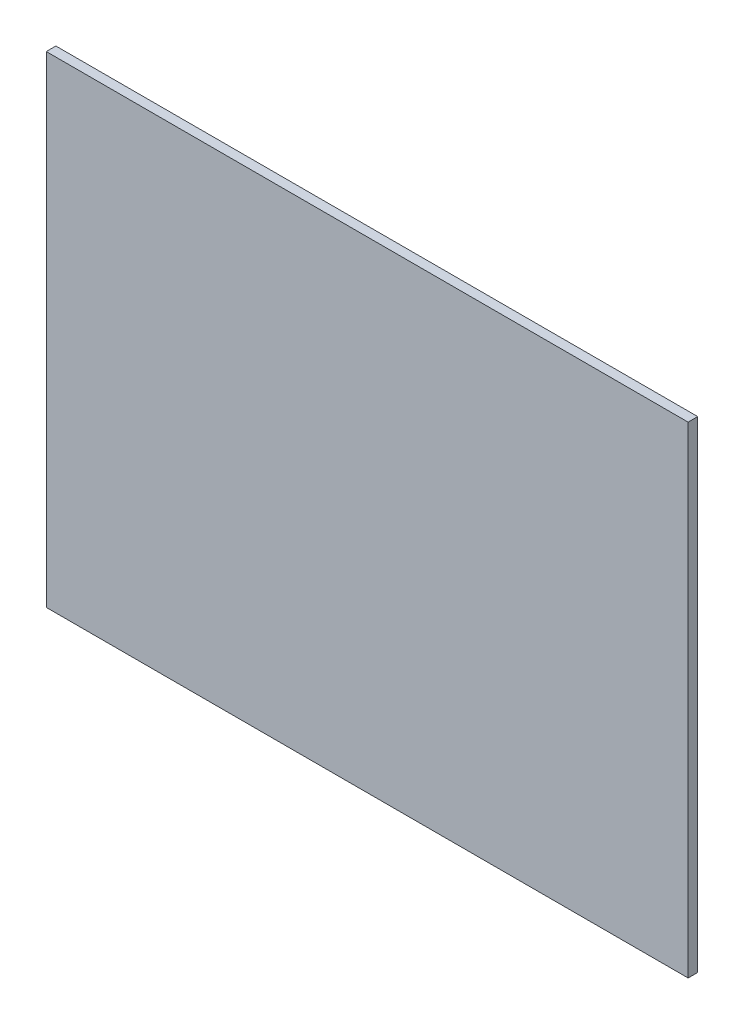
ISO-10303-21;
HEADER;
FILE_DESCRIPTION(('STEP AP214'),'2;1');
FILE_NAME('part.step','',(''),(''),'','','');
FILE_SCHEMA(('AUTOMOTIVE_DESIGN { 1 0 10303 214 1 1 1 1 }'));
ENDSEC;
DATA;
#1=APPLICATION_CONTEXT('core data for automotive mechanical design processes');
#2=APPLICATION_PROTOCOL_DEFINITION('international standard','automotive_design',2000,#1);
#3=PRODUCT_CONTEXT('',#1,'mechanical');
#4=PRODUCT('Part','Part','',(#3));
#5=PRODUCT_RELATED_PRODUCT_CATEGORY('part','',(#4));
#6=PRODUCT_DEFINITION_FORMATION('','',#4);
#7=PRODUCT_DEFINITION_CONTEXT('part definition',#1,'design');
#8=PRODUCT_DEFINITION('design','',#6,#7);
#9=PRODUCT_DEFINITION_SHAPE('','',#8);
#10=(LENGTH_UNIT() NAMED_UNIT(*) SI_UNIT(.MILLI.,.METRE.));
#11=(NAMED_UNIT(*) PLANE_ANGLE_UNIT() SI_UNIT($,.RADIAN.));
#12=(NAMED_UNIT(*) SI_UNIT($,.STERADIAN.) SOLID_ANGLE_UNIT());
#13=UNCERTAINTY_MEASURE_WITH_UNIT(LENGTH_MEASURE(1.E-05),#10,'distance_accuracy_value','');
#14=(GEOMETRIC_REPRESENTATION_CONTEXT(3) GLOBAL_UNCERTAINTY_ASSIGNED_CONTEXT((#13)) GLOBAL_UNIT_ASSIGNED_CONTEXT((#10,
#11,#12)) REPRESENTATION_CONTEXT('',''));
#15=CARTESIAN_POINT('',(0.,0.,0.));
#16=DIRECTION('',(0.,0.,1.));
#17=DIRECTION('',(1.,0.,0.));
#18=AXIS2_PLACEMENT_3D('',#15,#16,#17);
#19=CARTESIAN_POINT('',(609.6,-457.2,18.25625));
#20=DIRECTION('',(-1.,0.,0.));
#21=DIRECTION('',(0.,0.,1.));
#22=AXIS2_PLACEMENT_3D('',#19,#20,#21);
#23=PLANE('',#22);
#24=DIRECTION('',(0.,1.,0.));
#25=VECTOR('',#24,1.);
#26=CARTESIAN_POINT('',(609.6,-457.2,0.));
#27=LINE('',#26,#25);
#28=CARTESIAN_POINT('',(609.6,-457.2,0.));
#29=VERTEX_POINT('',#28);
#30=CARTESIAN_POINT('',(609.6,457.2,0.));
#31=VERTEX_POINT('',#30);
#32=EDGE_CURVE('E107',#29,#31,#27,.T.);
#33=ORIENTED_EDGE('',*,*,#32,.T.);
#34=DIRECTION('',(0.,0.,-1.));
#35=VECTOR('',#34,1.);
#36=CARTESIAN_POINT('',(609.6,457.2,18.25625));
#37=LINE('',#36,#35);
#38=CARTESIAN_POINT('',(609.6,457.2,18.25625));
#39=VERTEX_POINT('',#38);
#40=EDGE_CURVE('E11',#39,#31,#37,.T.);
#41=ORIENTED_EDGE('',*,*,#40,.F.);
#42=DIRECTION('',(0.,1.,0.));
#43=VECTOR('',#42,1.);
#44=CARTESIAN_POINT('',(609.6,-457.2,18.25625));
#45=LINE('',#44,#43);
#46=CARTESIAN_POINT('',(609.6,-457.2,18.25625));
#47=VERTEX_POINT('',#46);
#48=EDGE_CURVE('E91',#47,#39,#45,.T.);
#49=ORIENTED_EDGE('',*,*,#48,.F.);
#50=DIRECTION('',(0.,0.,-1.));
#51=VECTOR('',#50,1.);
#52=CARTESIAN_POINT('',(609.6,-457.2,18.25625));
#53=LINE('',#52,#51);
#54=EDGE_CURVE('E103',#47,#29,#53,.T.);
#55=ORIENTED_EDGE('',*,*,#54,.T.);
#56=EDGE_LOOP('',(#33,#41,#49,#55));
#57=FACE_BOUND('',#56,.T.);
#58=ADVANCED_FACE('F39',(#57),#23,.F.);
#59=CARTESIAN_POINT('',(-609.6,457.2,18.25625));
#60=DIRECTION('',(0.,-1.,0.));
#61=DIRECTION('',(0.,0.,-1.));
#62=AXIS2_PLACEMENT_3D('',#59,#60,#61);
#63=PLANE('',#62);
#64=DIRECTION('',(-1.,0.,0.));
#65=VECTOR('',#64,1.);
#66=CARTESIAN_POINT('',(-609.6,457.2,0.));
#67=LINE('',#66,#65);
#68=CARTESIAN_POINT('',(-609.6,457.2,0.));
#69=VERTEX_POINT('',#68);
#70=EDGE_CURVE('E96',#31,#69,#67,.T.);
#71=ORIENTED_EDGE('',*,*,#70,.T.);
#72=DIRECTION('',(0.,0.,-1.));
#73=VECTOR('',#72,1.);
#74=CARTESIAN_POINT('',(-609.6,457.2,18.25625));
#75=LINE('',#74,#73);
#76=CARTESIAN_POINT('',(-609.6,457.2,18.25625));
#77=VERTEX_POINT('',#76);
#78=EDGE_CURVE('E48',#77,#69,#75,.T.);
#79=ORIENTED_EDGE('',*,*,#78,.F.);
#80=DIRECTION('',(-1.,0.,0.));
#81=VECTOR('',#80,1.);
#82=CARTESIAN_POINT('',(-609.6,457.2,18.25625));
#83=LINE('',#82,#81);
#84=EDGE_CURVE('E86',#39,#77,#83,.T.);
#85=ORIENTED_EDGE('',*,*,#84,.F.);
#86=ORIENTED_EDGE('',*,*,#40,.T.);
#87=EDGE_LOOP('',(#71,#79,#85,#86));
#88=FACE_BOUND('',#87,.T.);
#89=ADVANCED_FACE('F95',(#88),#63,.F.);
#90=CARTESIAN_POINT('',(-609.6,-457.2,18.25625));
#91=DIRECTION('',(1.,0.,0.));
#92=DIRECTION('',(0.,0.,-1.));
#93=AXIS2_PLACEMENT_3D('',#90,#91,#92);
#94=PLANE('',#93);
#95=DIRECTION('',(0.,-1.,0.));
#96=VECTOR('',#95,1.);
#97=CARTESIAN_POINT('',(-609.6,-457.2,0.));
#98=LINE('',#97,#96);
#99=CARTESIAN_POINT('',(-609.6,-457.2,0.));
#100=VERTEX_POINT('',#99);
#101=EDGE_CURVE('E73',#69,#100,#98,.T.);
#102=ORIENTED_EDGE('',*,*,#101,.T.);
#103=DIRECTION('',(0.,0.,-1.));
#104=VECTOR('',#103,1.);
#105=CARTESIAN_POINT('',(-609.6,-457.2,18.25625));
#106=LINE('',#105,#104);
#107=CARTESIAN_POINT('',(-609.6,-457.2,18.25625));
#108=VERTEX_POINT('',#107);
#109=EDGE_CURVE('E98',#108,#100,#106,.T.);
#110=ORIENTED_EDGE('',*,*,#109,.F.);
#111=DIRECTION('',(0.,-1.,0.));
#112=VECTOR('',#111,1.);
#113=CARTESIAN_POINT('',(-609.6,-457.2,18.25625));
#114=LINE('',#113,#112);
#115=EDGE_CURVE('E89',#77,#108,#114,.T.);
#116=ORIENTED_EDGE('',*,*,#115,.F.);
#117=ORIENTED_EDGE('',*,*,#78,.T.);
#118=EDGE_LOOP('',(#102,#110,#116,#117));
#119=FACE_BOUND('',#118,.T.);
#120=ADVANCED_FACE('F99',(#119),#94,.F.);
#121=CARTESIAN_POINT('',(-609.6,-457.2,18.25625));
#122=DIRECTION('',(0.,1.,0.));
#123=DIRECTION('',(0.,0.,1.));
#124=AXIS2_PLACEMENT_3D('',#121,#122,#123);
#125=PLANE('',#124);
#126=DIRECTION('',(1.,0.,0.));
#127=VECTOR('',#126,1.);
#128=CARTESIAN_POINT('',(-609.6,-457.2,0.));
#129=LINE('',#128,#127);
#130=EDGE_CURVE('E79',#100,#29,#129,.T.);
#131=ORIENTED_EDGE('',*,*,#130,.T.);
#132=ORIENTED_EDGE('',*,*,#54,.F.);
#133=DIRECTION('',(1.,0.,0.));
#134=VECTOR('',#133,1.);
#135=CARTESIAN_POINT('',(-609.6,-457.2,18.25625));
#136=LINE('',#135,#134);
#137=EDGE_CURVE('E56',#108,#47,#136,.T.);
#138=ORIENTED_EDGE('',*,*,#137,.F.);
#139=ORIENTED_EDGE('',*,*,#109,.T.);
#140=EDGE_LOOP('',(#131,#132,#138,#139));
#141=FACE_BOUND('',#140,.T.);
#142=ADVANCED_FACE('F120',(#141),#125,.F.);
#143=CARTESIAN_POINT('',(0.,0.,18.25625));
#144=DIRECTION('',(0.,0.,-1.));
#145=DIRECTION('',(-1.,0.,0.));
#146=AXIS2_PLACEMENT_3D('',#143,#144,#145);
#147=PLANE('',#146);
#148=ORIENTED_EDGE('',*,*,#48,.T.);
#149=ORIENTED_EDGE('',*,*,#84,.T.);
#150=ORIENTED_EDGE('',*,*,#115,.T.);
#151=ORIENTED_EDGE('',*,*,#137,.T.);
#152=EDGE_LOOP('',(#148,#149,#150,#151));
#153=FACE_BOUND('',#152,.T.);
#154=ADVANCED_FACE('F87',(#153),#147,.F.);
#155=CARTESIAN_POINT('',(0.,0.,0.));
#156=DIRECTION('',(0.,0.,-1.));
#157=DIRECTION('',(-1.,0.,0.));
#158=AXIS2_PLACEMENT_3D('',#155,#156,#157);
#159=PLANE('',#158);
#160=ORIENTED_EDGE('',*,*,#32,.F.);
#161=ORIENTED_EDGE('',*,*,#130,.F.);
#162=ORIENTED_EDGE('',*,*,#101,.F.);
#163=ORIENTED_EDGE('',*,*,#70,.F.);
#164=EDGE_LOOP('',(#160,#161,#162,#163));
#165=FACE_BOUND('',#164,.T.);
#166=ADVANCED_FACE('F123',(#165),#159,.T.);
#167=CLOSED_SHELL('',(#58,#89,#120,#142,#154,#166));
#168=MANIFOLD_SOLID_BREP('B2',#167);
#169=ADVANCED_BREP_SHAPE_REPRESENTATION('',(#18,#168),#14);
#170=SHAPE_DEFINITION_REPRESENTATION(#9,#169);
ENDSEC;
END-ISO-10303-21;
